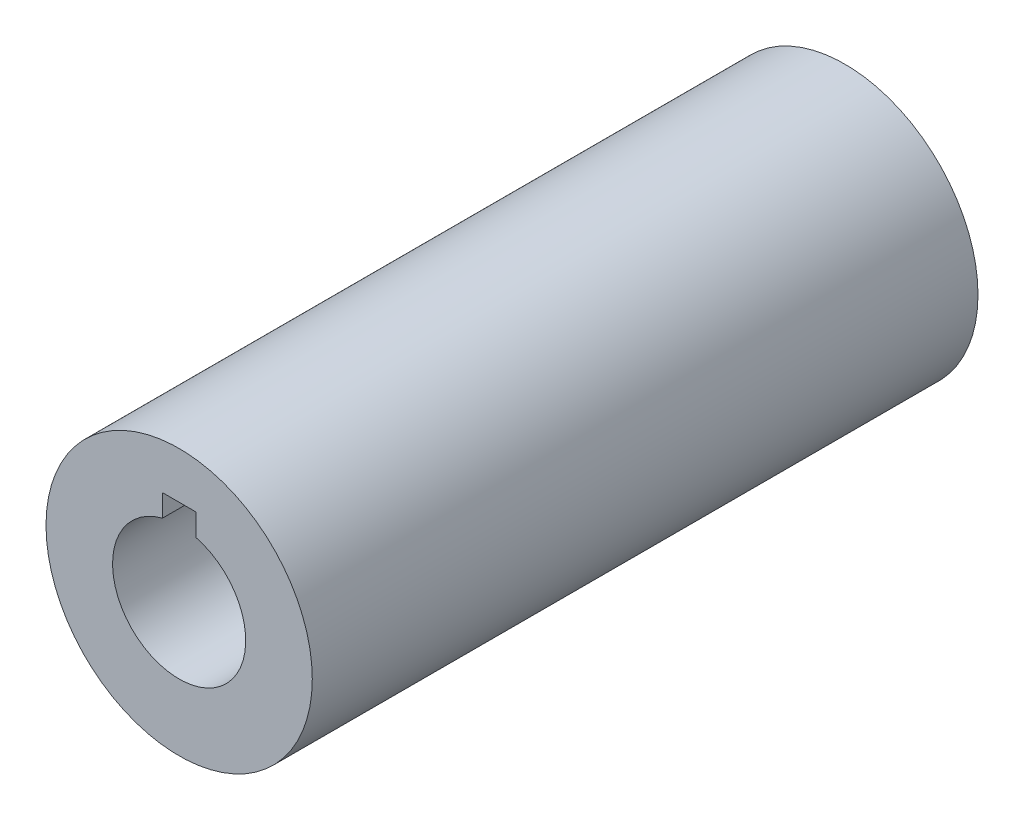
ISO-10303-21;
HEADER;
FILE_DESCRIPTION(('STEP AP214'),'2;1');
FILE_NAME('part.step','',(''),(''),'','','');
FILE_SCHEMA(('AUTOMOTIVE_DESIGN { 1 0 10303 214 1 1 1 1 }'));
ENDSEC;
DATA;
#1=APPLICATION_CONTEXT('core data for automotive mechanical design processes');
#2=APPLICATION_PROTOCOL_DEFINITION('international standard','automotive_design',2000,#1);
#3=PRODUCT_CONTEXT('',#1,'mechanical');
#4=PRODUCT('Part','Part','',(#3));
#5=PRODUCT_RELATED_PRODUCT_CATEGORY('part','',(#4));
#6=PRODUCT_DEFINITION_FORMATION('','',#4);
#7=PRODUCT_DEFINITION_CONTEXT('part definition',#1,'design');
#8=PRODUCT_DEFINITION('design','',#6,#7);
#9=PRODUCT_DEFINITION_SHAPE('','',#8);
#10=(LENGTH_UNIT() NAMED_UNIT(*) SI_UNIT(.MILLI.,.METRE.));
#11=(NAMED_UNIT(*) PLANE_ANGLE_UNIT() SI_UNIT($,.RADIAN.));
#12=(NAMED_UNIT(*) SI_UNIT($,.STERADIAN.) SOLID_ANGLE_UNIT());
#13=UNCERTAINTY_MEASURE_WITH_UNIT(LENGTH_MEASURE(1.E-05),#10,'distance_accuracy_value','');
#14=(GEOMETRIC_REPRESENTATION_CONTEXT(3) GLOBAL_UNCERTAINTY_ASSIGNED_CONTEXT((#13)) GLOBAL_UNIT_ASSIGNED_CONTEXT((#10,
#11,#12)) REPRESENTATION_CONTEXT('',''));
#15=CARTESIAN_POINT('',(0.,0.,0.));
#16=DIRECTION('',(0.,0.,1.));
#17=DIRECTION('',(1.,0.,0.));
#18=AXIS2_PLACEMENT_3D('',#15,#16,#17);
#19=CARTESIAN_POINT('',(0.,0.,50.));
#20=DIRECTION('',(0.,0.,1.));
#21=DIRECTION('',(1.,0.,0.));
#22=AXIS2_PLACEMENT_3D('',#19,#20,#21);
#23=PLANE('',#22);
#24=CARTESIAN_POINT('',(0.,0.,50.));
#25=DIRECTION('',(0.,0.,1.));
#26=DIRECTION('',(1.,0.,0.));
#27=AXIS2_PLACEMENT_3D('',#24,#25,#26);
#28=CIRCLE('',#27,20.);
#29=CARTESIAN_POINT('',(20.,0.,50.));
#30=VERTEX_POINT('',#29);
#31=EDGE_CURVE('E11',#30,#30,#28,.T.);
#32=ORIENTED_EDGE('',*,*,#31,.T.);
#33=EDGE_LOOP('',(#32));
#34=FACE_BOUND('',#33,.T.);
#35=DIRECTION('',(0.,1.,0.));
#36=VECTOR('',#35,1.);
#37=CARTESIAN_POINT('',(2.5,9.68245836551854,50.));
#38=LINE('',#37,#36);
#39=CARTESIAN_POINT('',(2.5,9.68245836551854,50.));
#40=VERTEX_POINT('',#39);
#41=CARTESIAN_POINT('',(2.5,13.,50.));
#42=VERTEX_POINT('',#41);
#43=EDGE_CURVE('E82',#40,#42,#38,.T.);
#44=ORIENTED_EDGE('',*,*,#43,.F.);
#45=CARTESIAN_POINT('',(0.,0.,50.));
#46=DIRECTION('',(0.,0.,1.));
#47=DIRECTION('',(1.,0.,0.));
#48=AXIS2_PLACEMENT_3D('',#45,#46,#47);
#49=CIRCLE('',#48,10.);
#50=CARTESIAN_POINT('',(-2.5,9.68245836551854,50.));
#51=VERTEX_POINT('',#50);
#52=EDGE_CURVE('E74',#51,#40,#49,.T.);
#53=ORIENTED_EDGE('',*,*,#52,.F.);
#54=DIRECTION('',(0.,-1.,0.));
#55=VECTOR('',#54,1.);
#56=CARTESIAN_POINT('',(-2.5,9.68245836551854,50.));
#57=LINE('',#56,#55);
#58=CARTESIAN_POINT('',(-2.5,13.,50.));
#59=VERTEX_POINT('',#58);
#60=EDGE_CURVE('E95',#59,#51,#57,.T.);
#61=ORIENTED_EDGE('',*,*,#60,.F.);
#62=DIRECTION('',(-1.,0.,0.));
#63=VECTOR('',#62,1.);
#64=CARTESIAN_POINT('',(-2.5,13.,50.));
#65=LINE('',#64,#63);
#66=EDGE_CURVE('E93',#42,#59,#65,.T.);
#67=ORIENTED_EDGE('',*,*,#66,.F.);
#68=EDGE_LOOP('',(#44,#53,#61,#67));
#69=FACE_BOUND('',#68,.T.);
#70=ADVANCED_FACE('F33',(#34,#69),#23,.T.);
#71=CARTESIAN_POINT('',(0.,0.,-50.));
#72=DIRECTION('',(0.,0.,1.));
#73=DIRECTION('',(1.,0.,0.));
#74=AXIS2_PLACEMENT_3D('',#71,#72,#73);
#75=PLANE('',#74);
#76=CARTESIAN_POINT('',(0.,0.,-50.));
#77=DIRECTION('',(0.,0.,1.));
#78=DIRECTION('',(1.,0.,0.));
#79=AXIS2_PLACEMENT_3D('',#76,#77,#78);
#80=CIRCLE('',#79,20.);
#81=CARTESIAN_POINT('',(20.,0.,-50.));
#82=VERTEX_POINT('',#81);
#83=EDGE_CURVE('E37',#82,#82,#80,.T.);
#84=ORIENTED_EDGE('',*,*,#83,.F.);
#85=EDGE_LOOP('',(#84));
#86=FACE_BOUND('',#85,.T.);
#87=CARTESIAN_POINT('',(0.,0.,-50.));
#88=DIRECTION('',(0.,0.,1.));
#89=DIRECTION('',(1.,0.,0.));
#90=AXIS2_PLACEMENT_3D('',#87,#88,#89);
#91=CIRCLE('',#90,10.);
#92=CARTESIAN_POINT('',(-2.5,9.68245836551854,-50.));
#93=VERTEX_POINT('',#92);
#94=CARTESIAN_POINT('',(2.5,9.68245836551854,-50.));
#95=VERTEX_POINT('',#94);
#96=EDGE_CURVE('E56',#93,#95,#91,.T.);
#97=ORIENTED_EDGE('',*,*,#96,.T.);
#98=DIRECTION('',(0.,1.,0.));
#99=VECTOR('',#98,1.);
#100=CARTESIAN_POINT('',(2.5,9.68245836551854,-50.));
#101=LINE('',#100,#99);
#102=CARTESIAN_POINT('',(2.5,13.,-50.));
#103=VERTEX_POINT('',#102);
#104=EDGE_CURVE('E89',#95,#103,#101,.T.);
#105=ORIENTED_EDGE('',*,*,#104,.T.);
#106=DIRECTION('',(-1.,0.,0.));
#107=VECTOR('',#106,1.);
#108=CARTESIAN_POINT('',(-2.5,13.,-50.));
#109=LINE('',#108,#107);
#110=CARTESIAN_POINT('',(-2.5,13.,-50.));
#111=VERTEX_POINT('',#110);
#112=EDGE_CURVE('E101',#103,#111,#109,.T.);
#113=ORIENTED_EDGE('',*,*,#112,.T.);
#114=DIRECTION('',(0.,-1.,0.));
#115=VECTOR('',#114,1.);
#116=CARTESIAN_POINT('',(-2.5,9.68245836551854,-50.));
#117=LINE('',#116,#115);
#118=EDGE_CURVE('E83',#111,#93,#117,.T.);
#119=ORIENTED_EDGE('',*,*,#118,.T.);
#120=EDGE_LOOP('',(#97,#105,#113,#119));
#121=FACE_BOUND('',#120,.T.);
#122=ADVANCED_FACE('F112',(#86,#121),#75,.F.);
#123=CARTESIAN_POINT('',(0.,0.,50.));
#124=DIRECTION('',(0.,0.,-1.));
#125=DIRECTION('',(-1.,0.,0.));
#126=AXIS2_PLACEMENT_3D('',#123,#124,#125);
#127=CYLINDRICAL_SURFACE('',#126,20.);
#128=ORIENTED_EDGE('',*,*,#31,.F.);
#129=EDGE_LOOP('',(#128));
#130=FACE_BOUND('',#129,.T.);
#131=ORIENTED_EDGE('',*,*,#83,.T.);
#132=EDGE_LOOP('',(#131));
#133=FACE_BOUND('',#132,.T.);
#134=ADVANCED_FACE('F35',(#130,#133),#127,.T.);
#135=CARTESIAN_POINT('',(0.,0.,50.));
#136=DIRECTION('',(0.,0.,-1.));
#137=DIRECTION('',(-1.,0.,0.));
#138=AXIS2_PLACEMENT_3D('',#135,#136,#137);
#139=CYLINDRICAL_SURFACE('',#138,10.);
#140=ORIENTED_EDGE('',*,*,#96,.F.);
#141=DIRECTION('',(0.,0.,-1.));
#142=VECTOR('',#141,1.);
#143=CARTESIAN_POINT('',(-2.5,9.68245836551854,50.));
#144=LINE('',#143,#142);
#145=EDGE_CURVE('E78',#51,#93,#144,.T.);
#146=ORIENTED_EDGE('',*,*,#145,.F.);
#147=ORIENTED_EDGE('',*,*,#52,.T.);
#148=DIRECTION('',(0.,0.,-1.));
#149=VECTOR('',#148,1.);
#150=CARTESIAN_POINT('',(2.5,9.68245836551854,50.));
#151=LINE('',#150,#149);
#152=EDGE_CURVE('E77',#40,#95,#151,.T.);
#153=ORIENTED_EDGE('',*,*,#152,.T.);
#154=EDGE_LOOP('',(#140,#146,#147,#153));
#155=FACE_BOUND('',#154,.T.);
#156=ADVANCED_FACE('F76',(#155),#139,.F.);
#157=CARTESIAN_POINT('',(2.5,9.68245836551854,50.));
#158=DIRECTION('',(-1.,0.,0.));
#159=DIRECTION('',(0.,-1.,0.));
#160=AXIS2_PLACEMENT_3D('',#157,#158,#159);
#161=PLANE('',#160);
#162=ORIENTED_EDGE('',*,*,#104,.F.);
#163=ORIENTED_EDGE('',*,*,#152,.F.);
#164=ORIENTED_EDGE('',*,*,#43,.T.);
#165=DIRECTION('',(0.,0.,-1.));
#166=VECTOR('',#165,1.);
#167=CARTESIAN_POINT('',(2.5,13.,50.));
#168=LINE('',#167,#166);
#169=EDGE_CURVE('E90',#42,#103,#168,.T.);
#170=ORIENTED_EDGE('',*,*,#169,.T.);
#171=EDGE_LOOP('',(#162,#163,#164,#170));
#172=FACE_BOUND('',#171,.T.);
#173=ADVANCED_FACE('F86',(#172),#161,.T.);
#174=CARTESIAN_POINT('',(-2.5,13.,50.));
#175=DIRECTION('',(0.,-1.,0.));
#176=DIRECTION('',(0.,0.,-1.));
#177=AXIS2_PLACEMENT_3D('',#174,#175,#176);
#178=PLANE('',#177);
#179=ORIENTED_EDGE('',*,*,#112,.F.);
#180=ORIENTED_EDGE('',*,*,#169,.F.);
#181=ORIENTED_EDGE('',*,*,#66,.T.);
#182=DIRECTION('',(0.,0.,-1.));
#183=VECTOR('',#182,1.);
#184=CARTESIAN_POINT('',(-2.5,13.,50.));
#185=LINE('',#184,#183);
#186=EDGE_CURVE('E48',#59,#111,#185,.T.);
#187=ORIENTED_EDGE('',*,*,#186,.T.);
#188=EDGE_LOOP('',(#179,#180,#181,#187));
#189=FACE_BOUND('',#188,.T.);
#190=ADVANCED_FACE('F110',(#189),#178,.T.);
#191=CARTESIAN_POINT('',(-2.5,9.68245836551854,50.));
#192=DIRECTION('',(1.,0.,0.));
#193=DIRECTION('',(0.,1.,0.));
#194=AXIS2_PLACEMENT_3D('',#191,#192,#193);
#195=PLANE('',#194);
#196=ORIENTED_EDGE('',*,*,#118,.F.);
#197=ORIENTED_EDGE('',*,*,#186,.F.);
#198=ORIENTED_EDGE('',*,*,#60,.T.);
#199=ORIENTED_EDGE('',*,*,#145,.T.);
#200=EDGE_LOOP('',(#196,#197,#198,#199));
#201=FACE_BOUND('',#200,.T.);
#202=ADVANCED_FACE('F113',(#201),#195,.T.);
#203=CLOSED_SHELL('',(#70,#122,#134,#156,#173,#190,#202));
#204=MANIFOLD_SOLID_BREP('B2',#203);
#205=ADVANCED_BREP_SHAPE_REPRESENTATION('',(#18,#204),#14);
#206=SHAPE_DEFINITION_REPRESENTATION(#9,#205);
ENDSEC;
END-ISO-10303-21;
